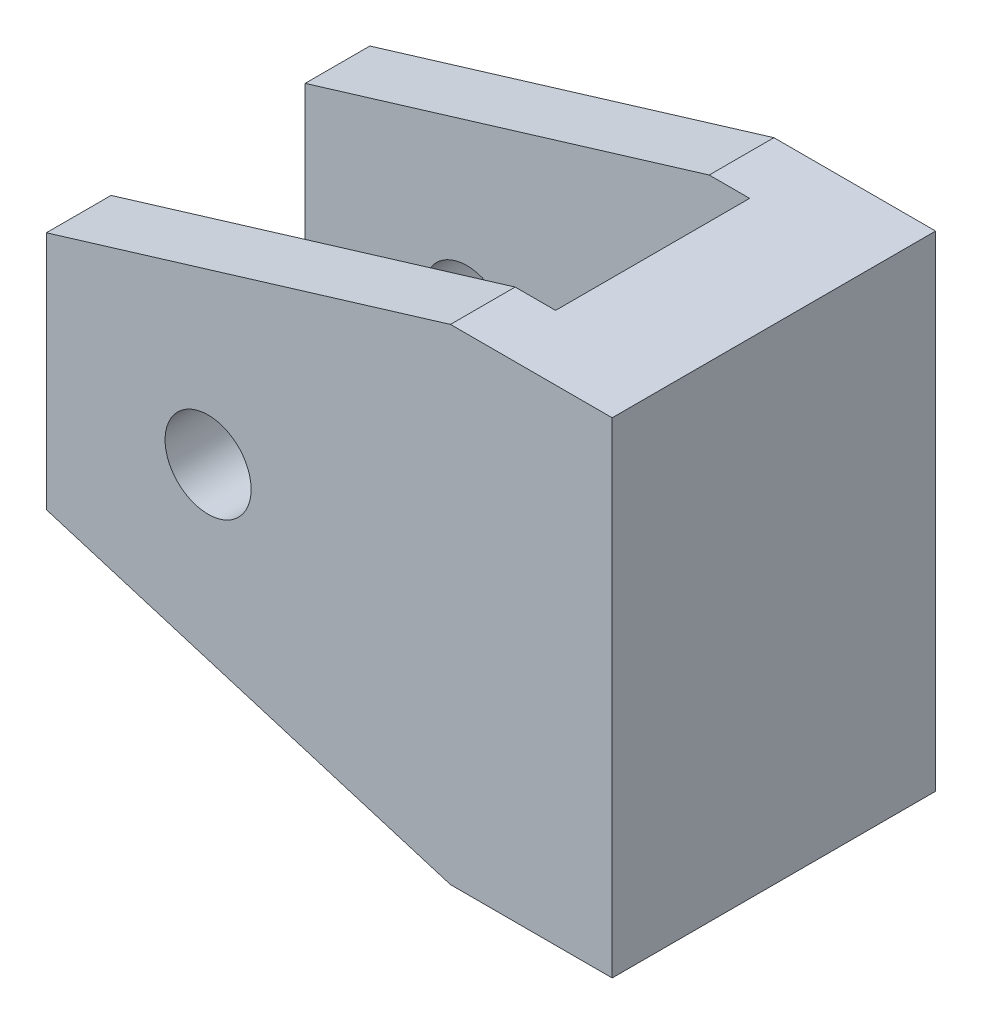
ISO-10303-21;
HEADER;
FILE_DESCRIPTION(('STEP AP214'),'2;1');
FILE_NAME('part.step','',(''),(''),'','','');
FILE_SCHEMA(('AUTOMOTIVE_DESIGN { 1 0 10303 214 1 1 1 1 }'));
ENDSEC;
DATA;
#1=APPLICATION_CONTEXT('core data for automotive mechanical design processes');
#2=APPLICATION_PROTOCOL_DEFINITION('international standard','automotive_design',2000,#1);
#3=PRODUCT_CONTEXT('',#1,'mechanical');
#4=PRODUCT('Part','Part','',(#3));
#5=PRODUCT_RELATED_PRODUCT_CATEGORY('part','',(#4));
#6=PRODUCT_DEFINITION_FORMATION('','',#4);
#7=PRODUCT_DEFINITION_CONTEXT('part definition',#1,'design');
#8=PRODUCT_DEFINITION('design','',#6,#7);
#9=PRODUCT_DEFINITION_SHAPE('','',#8);
#10=(LENGTH_UNIT() NAMED_UNIT(*) SI_UNIT(.MILLI.,.METRE.));
#11=(NAMED_UNIT(*) PLANE_ANGLE_UNIT() SI_UNIT($,.RADIAN.));
#12=(NAMED_UNIT(*) SI_UNIT($,.STERADIAN.) SOLID_ANGLE_UNIT());
#13=UNCERTAINTY_MEASURE_WITH_UNIT(LENGTH_MEASURE(1.E-05),#10,'distance_accuracy_value','');
#14=(GEOMETRIC_REPRESENTATION_CONTEXT(3) GLOBAL_UNCERTAINTY_ASSIGNED_CONTEXT((#13)) GLOBAL_UNIT_ASSIGNED_CONTEXT((#10,
#11,#12)) REPRESENTATION_CONTEXT('',''));
#15=CARTESIAN_POINT('',(0.,0.,0.));
#16=DIRECTION('',(0.,0.,1.));
#17=DIRECTION('',(1.,0.,0.));
#18=AXIS2_PLACEMENT_3D('',#15,#16,#17);
#19=CARTESIAN_POINT('',(556.994122279688,-1577.4906897137,71.2313490571151));
#20=DIRECTION('',(0.290472817587144,0.956883243788387,0.));
#21=DIRECTION('',(-0.956883243788387,0.290472817587144,0.));
#22=AXIS2_PLACEMENT_3D('',#19,#20,#21);
#23=PLANE('',#22);
#24=DIRECTION('',(0.,0.,-1.));
#25=VECTOR('',#24,1.);
#26=CARTESIAN_POINT('',(588.727317330752,-1587.12366284533,71.2313490571151));
#27=LINE('',#26,#25);
#28=CARTESIAN_POINT('',(588.727317330752,-1587.12366284533,-7.62));
#29=VERTEX_POINT('',#28);
#30=CARTESIAN_POINT('',(588.727317330752,-1587.12366284533,-12.7));
#31=VERTEX_POINT('',#30);
#32=EDGE_CURVE('E200',#29,#31,#27,.T.);
#33=ORIENTED_EDGE('',*,*,#32,.F.);
#34=DIRECTION('',(-0.956883243788387,0.290472817587144,0.));
#35=VECTOR('',#34,1.);
#36=CARTESIAN_POINT('',(556.994122279688,-1577.4906897137,-7.62));
#37=LINE('',#36,#35);
#38=CARTESIAN_POINT('',(556.994122279688,-1577.4906897137,-7.61999999999999));
#39=VERTEX_POINT('',#38);
#40=EDGE_CURVE('E163',#29,#39,#37,.T.);
#41=ORIENTED_EDGE('',*,*,#40,.T.);
#42=DIRECTION('',(0.,0.,-1.));
#43=VECTOR('',#42,1.);
#44=CARTESIAN_POINT('',(556.994122279688,-1577.4906897137,71.2313490571151));
#45=LINE('',#44,#43);
#46=CARTESIAN_POINT('',(556.994122279688,-1577.4906897137,-12.7));
#47=VERTEX_POINT('',#46);
#48=EDGE_CURVE('E202',#39,#47,#45,.T.);
#49=ORIENTED_EDGE('',*,*,#48,.T.);
#50=DIRECTION('',(0.956883243788387,-0.290472817587144,0.));
#51=VECTOR('',#50,1.);
#52=CARTESIAN_POINT('',(556.994122279688,-1577.4906897137,-12.7));
#53=LINE('',#52,#51);
#54=EDGE_CURVE('E180',#47,#31,#53,.T.);
#55=ORIENTED_EDGE('',*,*,#54,.T.);
#56=EDGE_LOOP('',(#33,#41,#49,#55));
#57=FACE_BOUND('',#56,.T.);
#58=ADVANCED_FACE('F33',(#57),#23,.F.);
#59=CARTESIAN_POINT('',(556.994122279688,-1558.65663597697,71.2313490571151));
#60=DIRECTION('',(1.,0.,0.));
#61=DIRECTION('',(0.,0.,-1.));
#62=AXIS2_PLACEMENT_3D('',#59,#60,#61);
#63=PLANE('',#62);
#64=ORIENTED_EDGE('',*,*,#48,.F.);
#65=DIRECTION('',(0.,-1.,0.));
#66=VECTOR('',#65,1.);
#67=CARTESIAN_POINT('',(556.994122279688,-1510.93377335057,-7.61999999999999));
#68=LINE('',#67,#66);
#69=CARTESIAN_POINT('',(556.994122279688,-1558.65663597697,-7.61999999999999));
#70=VERTEX_POINT('',#69);
#71=EDGE_CURVE('E152',#70,#39,#68,.T.);
#72=ORIENTED_EDGE('',*,*,#71,.F.);
#73=DIRECTION('',(0.,0.,-1.));
#74=VECTOR('',#73,1.);
#75=CARTESIAN_POINT('',(556.994122279688,-1558.65663597697,71.2313490571151));
#76=LINE('',#75,#74);
#77=CARTESIAN_POINT('',(556.994122279688,-1558.65663597697,-12.7));
#78=VERTEX_POINT('',#77);
#79=EDGE_CURVE('E206',#70,#78,#76,.T.);
#80=ORIENTED_EDGE('',*,*,#79,.T.);
#81=DIRECTION('',(0.,-1.,0.));
#82=VECTOR('',#81,1.);
#83=CARTESIAN_POINT('',(556.994122279688,-1558.65663597697,-12.7));
#84=LINE('',#83,#82);
#85=EDGE_CURVE('E169',#78,#47,#84,.T.);
#86=ORIENTED_EDGE('',*,*,#85,.T.);
#87=EDGE_LOOP('',(#64,#72,#80,#86));
#88=FACE_BOUND('',#87,.T.);
#89=ADVANCED_FACE('F242',(#88),#63,.F.);
#90=CARTESIAN_POINT('',(588.727317330752,-1549.02366284533,71.2313490571151));
#91=DIRECTION('',(0.290472817587131,-0.956883243788391,0.));
#92=DIRECTION('',(0.956883243788391,0.290472817587131,0.));
#93=AXIS2_PLACEMENT_3D('',#90,#91,#92);
#94=PLANE('',#93);
#95=ORIENTED_EDGE('',*,*,#79,.F.);
#96=DIRECTION('',(0.956883243788391,0.290472817587131,0.));
#97=VECTOR('',#96,1.);
#98=CARTESIAN_POINT('',(588.727317330752,-1549.02366284533,-7.62));
#99=LINE('',#98,#97);
#100=CARTESIAN_POINT('',(588.727317330752,-1549.02366284533,-7.62));
#101=VERTEX_POINT('',#100);
#102=EDGE_CURVE('E160',#70,#101,#99,.T.);
#103=ORIENTED_EDGE('',*,*,#102,.T.);
#104=DIRECTION('',(0.,0.,-1.));
#105=VECTOR('',#104,1.);
#106=CARTESIAN_POINT('',(588.727317330752,-1549.02366284533,71.2313490571151));
#107=LINE('',#106,#105);
#108=CARTESIAN_POINT('',(588.727317330752,-1549.02366284533,-12.7));
#109=VERTEX_POINT('',#108);
#110=EDGE_CURVE('E210',#101,#109,#107,.T.);
#111=ORIENTED_EDGE('',*,*,#110,.T.);
#112=DIRECTION('',(-0.956883243788391,-0.290472817587131,0.));
#113=VECTOR('',#112,1.);
#114=CARTESIAN_POINT('',(588.727317330752,-1549.02366284533,-12.7));
#115=LINE('',#114,#113);
#116=EDGE_CURVE('E166',#109,#78,#115,.T.);
#117=ORIENTED_EDGE('',*,*,#116,.T.);
#118=EDGE_LOOP('',(#95,#103,#111,#117));
#119=FACE_BOUND('',#118,.T.);
#120=ADVANCED_FACE('F246',(#119),#94,.F.);
#121=CARTESIAN_POINT('',(601.427317330752,-1549.02366284533,71.2313490571151));
#122=DIRECTION('',(-1.,0.,0.));
#123=DIRECTION('',(0.,0.,1.));
#124=AXIS2_PLACEMENT_3D('',#121,#122,#123);
#125=PLANE('',#124);
#126=DIRECTION('',(0.,0.,-1.));
#127=VECTOR('',#126,1.);
#128=CARTESIAN_POINT('',(601.427317330752,-1549.02366284533,71.2313490571151));
#129=LINE('',#128,#127);
#130=CARTESIAN_POINT('',(601.427317330752,-1549.02366284533,12.7000000000001));
#131=VERTEX_POINT('',#130);
#132=CARTESIAN_POINT('',(601.427317330752,-1549.02366284533,-12.7));
#133=VERTEX_POINT('',#132);
#134=EDGE_CURVE('E173',#131,#133,#129,.T.);
#135=ORIENTED_EDGE('',*,*,#134,.F.);
#136=DIRECTION('',(0.,-1.,0.));
#137=VECTOR('',#136,1.);
#138=CARTESIAN_POINT('',(601.427317330752,-1549.02366284533,12.7000000000001));
#139=LINE('',#138,#137);
#140=CARTESIAN_POINT('',(601.427317330752,-1587.12366284533,12.7000000000001));
#141=VERTEX_POINT('',#140);
#142=EDGE_CURVE('E188',#131,#141,#139,.T.);
#143=ORIENTED_EDGE('',*,*,#142,.T.);
#144=DIRECTION('',(0.,0.,-1.));
#145=VECTOR('',#144,1.);
#146=CARTESIAN_POINT('',(601.427317330752,-1587.12366284533,71.2313490571151));
#147=LINE('',#146,#145);
#148=CARTESIAN_POINT('',(601.427317330752,-1587.12366284533,-12.7));
#149=VERTEX_POINT('',#148);
#150=EDGE_CURVE('E198',#141,#149,#147,.T.);
#151=ORIENTED_EDGE('',*,*,#150,.T.);
#152=DIRECTION('',(0.,1.,0.));
#153=VECTOR('',#152,1.);
#154=CARTESIAN_POINT('',(601.427317330752,-1549.02366284533,-12.7));
#155=LINE('',#154,#153);
#156=EDGE_CURVE('E174',#149,#133,#155,.T.);
#157=ORIENTED_EDGE('',*,*,#156,.T.);
#158=EDGE_LOOP('',(#135,#143,#151,#157));
#159=FACE_BOUND('',#158,.T.);
#160=ADVANCED_FACE('F217',(#159),#125,.F.);
#161=CARTESIAN_POINT('',(588.727317330752,-1587.12366284533,71.2313490571151));
#162=DIRECTION('',(0.,1.,0.));
#163=DIRECTION('',(0.,0.,1.));
#164=AXIS2_PLACEMENT_3D('',#161,#162,#163);
#165=PLANE('',#164);
#166=DIRECTION('',(0.,0.,1.));
#167=VECTOR('',#166,1.);
#168=CARTESIAN_POINT('',(591.902317330752,-1587.12366284533,7.62));
#169=LINE('',#168,#167);
#170=CARTESIAN_POINT('',(591.902317330752,-1587.12366284533,-7.62));
#171=VERTEX_POINT('',#170);
#172=CARTESIAN_POINT('',(591.902317330752,-1587.12366284533,7.62));
#173=VERTEX_POINT('',#172);
#174=EDGE_CURVE('E133',#171,#173,#169,.T.);
#175=ORIENTED_EDGE('',*,*,#174,.F.);
#176=DIRECTION('',(1.,0.,0.));
#177=VECTOR('',#176,1.);
#178=CARTESIAN_POINT('',(591.902317330752,-1587.12366284533,-7.62));
#179=LINE('',#178,#177);
#180=EDGE_CURVE('E129',#29,#171,#179,.T.);
#181=ORIENTED_EDGE('',*,*,#180,.F.);
#182=ORIENTED_EDGE('',*,*,#32,.T.);
#183=DIRECTION('',(1.,0.,0.));
#184=VECTOR('',#183,1.);
#185=CARTESIAN_POINT('',(588.727317330752,-1587.12366284533,-12.7));
#186=LINE('',#185,#184);
#187=EDGE_CURVE('E177',#31,#149,#186,.T.);
#188=ORIENTED_EDGE('',*,*,#187,.T.);
#189=ORIENTED_EDGE('',*,*,#150,.F.);
#190=DIRECTION('',(-1.,0.,0.));
#191=VECTOR('',#190,1.);
#192=CARTESIAN_POINT('',(588.727317330752,-1587.12366284533,12.7000000000001));
#193=LINE('',#192,#191);
#194=CARTESIAN_POINT('',(588.727317330752,-1587.12366284533,12.7000000000001));
#195=VERTEX_POINT('',#194);
#196=EDGE_CURVE('E185',#141,#195,#193,.T.);
#197=ORIENTED_EDGE('',*,*,#196,.T.);
#198=CARTESIAN_POINT('',(588.727317330752,-1587.12366284533,7.62));
#199=VERTEX_POINT('',#198);
#200=EDGE_CURVE('E145',#195,#199,#27,.T.);
#201=ORIENTED_EDGE('',*,*,#200,.T.);
#202=DIRECTION('',(-1.,0.,0.));
#203=VECTOR('',#202,1.);
#204=CARTESIAN_POINT('',(591.902317330752,-1587.12366284533,7.62));
#205=LINE('',#204,#203);
#206=EDGE_CURVE('E124',#173,#199,#205,.T.);
#207=ORIENTED_EDGE('',*,*,#206,.F.);
#208=EDGE_LOOP('',(#175,#181,#182,#188,#189,#197,#201,#207));
#209=FACE_BOUND('',#208,.T.);
#210=ADVANCED_FACE('F142',(#209),#165,.F.);
#211=CARTESIAN_POINT('',(556.994122279688,-1577.4906897137,12.7000000000001));
#212=VERTEX_POINT('',#211);
#213=CARTESIAN_POINT('',(556.994122279688,-1577.4906897137,7.61999999999999));
#214=VERTEX_POINT('',#213);
#215=EDGE_CURVE('E203',#212,#214,#45,.T.);
#216=ORIENTED_EDGE('',*,*,#215,.T.);
#217=DIRECTION('',(0.956883243788387,-0.290472817587144,0.));
#218=VECTOR('',#217,1.);
#219=CARTESIAN_POINT('',(556.994122279688,-1577.4906897137,7.62));
#220=LINE('',#219,#218);
#221=EDGE_CURVE('E157',#214,#199,#220,.T.);
#222=ORIENTED_EDGE('',*,*,#221,.T.);
#223=ORIENTED_EDGE('',*,*,#200,.F.);
#224=DIRECTION('',(-0.956883243788387,0.290472817587144,0.));
#225=VECTOR('',#224,1.);
#226=CARTESIAN_POINT('',(556.994122279688,-1577.4906897137,12.7000000000001));
#227=LINE('',#226,#225);
#228=EDGE_CURVE('E187',#195,#212,#227,.T.);
#229=ORIENTED_EDGE('',*,*,#228,.T.);
#230=EDGE_LOOP('',(#216,#222,#223,#229));
#231=FACE_BOUND('',#230,.T.);
#232=ADVANCED_FACE('F231',(#231),#23,.F.);
#233=CARTESIAN_POINT('',(556.994122279688,-1558.65663597697,12.7000000000001));
#234=VERTEX_POINT('',#233);
#235=CARTESIAN_POINT('',(556.994122279688,-1558.65663597697,7.61999999999999));
#236=VERTEX_POINT('',#235);
#237=EDGE_CURVE('E207',#234,#236,#76,.T.);
#238=ORIENTED_EDGE('',*,*,#237,.T.);
#239=DIRECTION('',(0.,-1.,0.));
#240=VECTOR('',#239,1.);
#241=CARTESIAN_POINT('',(556.994122279688,-1510.93377335057,7.61999999999999));
#242=LINE('',#241,#240);
#243=EDGE_CURVE('E128',#236,#214,#242,.T.);
#244=ORIENTED_EDGE('',*,*,#243,.T.);
#245=ORIENTED_EDGE('',*,*,#215,.F.);
#246=DIRECTION('',(0.,1.,0.));
#247=VECTOR('',#246,1.);
#248=CARTESIAN_POINT('',(556.994122279688,-1558.65663597697,12.7000000000001));
#249=LINE('',#248,#247);
#250=EDGE_CURVE('E191',#212,#234,#249,.T.);
#251=ORIENTED_EDGE('',*,*,#250,.T.);
#252=EDGE_LOOP('',(#238,#244,#245,#251));
#253=FACE_BOUND('',#252,.T.);
#254=ADVANCED_FACE('F229',(#253),#63,.F.);
#255=CARTESIAN_POINT('',(588.727317330752,-1549.02366284533,12.7000000000001));
#256=VERTEX_POINT('',#255);
#257=CARTESIAN_POINT('',(588.727317330752,-1549.02366284533,7.62));
#258=VERTEX_POINT('',#257);
#259=EDGE_CURVE('E211',#256,#258,#107,.T.);
#260=ORIENTED_EDGE('',*,*,#259,.T.);
#261=DIRECTION('',(-0.956883243788391,-0.290472817587131,0.));
#262=VECTOR('',#261,1.);
#263=CARTESIAN_POINT('',(588.727317330752,-1549.02366284533,7.62));
#264=LINE('',#263,#262);
#265=EDGE_CURVE('E49',#258,#236,#264,.T.);
#266=ORIENTED_EDGE('',*,*,#265,.T.);
#267=ORIENTED_EDGE('',*,*,#237,.F.);
#268=DIRECTION('',(0.956883243788391,0.290472817587131,0.));
#269=VECTOR('',#268,1.);
#270=CARTESIAN_POINT('',(588.727317330752,-1549.02366284533,12.7000000000001));
#271=LINE('',#270,#269);
#272=EDGE_CURVE('E56',#234,#256,#271,.T.);
#273=ORIENTED_EDGE('',*,*,#272,.T.);
#274=EDGE_LOOP('',(#260,#266,#267,#273));
#275=FACE_BOUND('',#274,.T.);
#276=ADVANCED_FACE('F226',(#275),#94,.F.);
#277=CARTESIAN_POINT('',(601.427317330752,-1549.02366284533,71.2313490571151));
#278=DIRECTION('',(0.,-1.,0.));
#279=DIRECTION('',(0.,0.,-1.));
#280=AXIS2_PLACEMENT_3D('',#277,#278,#279);
#281=PLANE('',#280);
#282=ORIENTED_EDGE('',*,*,#110,.F.);
#283=DIRECTION('',(-1.,0.,0.));
#284=VECTOR('',#283,1.);
#285=CARTESIAN_POINT('',(591.902317330752,-1549.02366284533,-7.62));
#286=LINE('',#285,#284);
#287=CARTESIAN_POINT('',(591.902317330752,-1549.02366284533,-7.62));
#288=VERTEX_POINT('',#287);
#289=EDGE_CURVE('E151',#288,#101,#286,.T.);
#290=ORIENTED_EDGE('',*,*,#289,.F.);
#291=DIRECTION('',(0.,0.,-1.));
#292=VECTOR('',#291,1.);
#293=CARTESIAN_POINT('',(591.902317330752,-1549.02366284533,7.62));
#294=LINE('',#293,#292);
#295=CARTESIAN_POINT('',(591.902317330752,-1549.02366284533,7.62));
#296=VERTEX_POINT('',#295);
#297=EDGE_CURVE('E158',#296,#288,#294,.T.);
#298=ORIENTED_EDGE('',*,*,#297,.F.);
#299=DIRECTION('',(-1.,0.,0.));
#300=VECTOR('',#299,1.);
#301=CARTESIAN_POINT('',(601.427317330752,-1549.02366284533,7.62));
#302=LINE('',#301,#300);
#303=EDGE_CURVE('E11',#296,#258,#302,.T.);
#304=ORIENTED_EDGE('',*,*,#303,.T.);
#305=ORIENTED_EDGE('',*,*,#259,.F.);
#306=DIRECTION('',(1.,0.,0.));
#307=VECTOR('',#306,1.);
#308=CARTESIAN_POINT('',(601.427317330752,-1549.02366284533,12.7000000000001));
#309=LINE('',#308,#307);
#310=EDGE_CURVE('E42',#256,#131,#309,.T.);
#311=ORIENTED_EDGE('',*,*,#310,.T.);
#312=ORIENTED_EDGE('',*,*,#134,.T.);
#313=DIRECTION('',(-1.,0.,0.));
#314=VECTOR('',#313,1.);
#315=CARTESIAN_POINT('',(601.427317330752,-1549.02366284533,-12.7));
#316=LINE('',#315,#314);
#317=EDGE_CURVE('E170',#133,#109,#316,.T.);
#318=ORIENTED_EDGE('',*,*,#317,.T.);
#319=EDGE_LOOP('',(#282,#290,#298,#304,#305,#311,#312,#318));
#320=FACE_BOUND('',#319,.T.);
#321=ADVANCED_FACE('F35',(#320),#281,.F.);
#322=CARTESIAN_POINT('',(588.727317330752,6.26295879637654E-13,12.6999999999999));
#323=DIRECTION('',(0.,0.,-1.));
#324=DIRECTION('',(-1.,0.,0.));
#325=AXIS2_PLACEMENT_3D('',#322,#323,#324);
#326=PLANE('',#325);
#327=CARTESIAN_POINT('',(569.694122279688,-1568.07366284533,12.6999999999999));
#328=DIRECTION('',(0.,0.,1.));
#329=DIRECTION('',(1.,0.,0.));
#330=AXIS2_PLACEMENT_3D('',#327,#328,#329);
#331=CIRCLE('',#330,3.3782);
#332=CARTESIAN_POINT('',(573.072322279688,-1568.07366284533,12.6999999999999));
#333=VERTEX_POINT('',#332);
#334=EDGE_CURVE('E256',#333,#333,#331,.T.);
#335=ORIENTED_EDGE('',*,*,#334,.F.);
#336=EDGE_LOOP('',(#335));
#337=FACE_BOUND('',#336,.T.);
#338=ORIENTED_EDGE('',*,*,#272,.F.);
#339=ORIENTED_EDGE('',*,*,#250,.F.);
#340=ORIENTED_EDGE('',*,*,#228,.F.);
#341=ORIENTED_EDGE('',*,*,#196,.F.);
#342=ORIENTED_EDGE('',*,*,#142,.F.);
#343=ORIENTED_EDGE('',*,*,#310,.F.);
#344=EDGE_LOOP('',(#338,#339,#340,#341,#342,#343));
#345=FACE_BOUND('',#344,.T.);
#346=ADVANCED_FACE('F220',(#337,#345),#326,.F.);
#347=CARTESIAN_POINT('',(647.217818529146,-1549.02366284533,-12.7));
#348=DIRECTION('',(0.,0.,-1.));
#349=DIRECTION('',(-1.,0.,0.));
#350=AXIS2_PLACEMENT_3D('',#347,#348,#349);
#351=PLANE('',#350);
#352=CARTESIAN_POINT('',(569.694122279688,-1568.07366284533,-12.7000000000001));
#353=DIRECTION('',(0.,0.,1.));
#354=DIRECTION('',(1.,0.,0.));
#355=AXIS2_PLACEMENT_3D('',#352,#353,#354);
#356=CIRCLE('',#355,3.3782);
#357=CARTESIAN_POINT('',(573.072322279688,-1568.07366284533,-12.7000000000001));
#358=VERTEX_POINT('',#357);
#359=EDGE_CURVE('E253',#358,#358,#356,.T.);
#360=ORIENTED_EDGE('',*,*,#359,.T.);
#361=EDGE_LOOP('',(#360));
#362=FACE_BOUND('',#361,.T.);
#363=ORIENTED_EDGE('',*,*,#317,.F.);
#364=ORIENTED_EDGE('',*,*,#156,.F.);
#365=ORIENTED_EDGE('',*,*,#187,.F.);
#366=ORIENTED_EDGE('',*,*,#54,.F.);
#367=ORIENTED_EDGE('',*,*,#85,.F.);
#368=ORIENTED_EDGE('',*,*,#116,.F.);
#369=EDGE_LOOP('',(#363,#364,#365,#366,#367,#368));
#370=FACE_BOUND('',#369,.T.);
#371=ADVANCED_FACE('F236',(#362,#370),#351,.T.);
#372=CARTESIAN_POINT('',(591.902317330752,-1510.93377335057,-7.62));
#373=DIRECTION('',(0.,0.,-1.));
#374=DIRECTION('',(-1.,0.,0.));
#375=AXIS2_PLACEMENT_3D('',#372,#373,#374);
#376=PLANE('',#375);
#377=CARTESIAN_POINT('',(569.694122279688,-1568.07366284533,-7.61999999999999));
#378=DIRECTION('',(0.,0.,-1.));
#379=DIRECTION('',(-1.,0.,0.));
#380=AXIS2_PLACEMENT_3D('',#377,#378,#379);
#381=CIRCLE('',#380,3.3782);
#382=CARTESIAN_POINT('',(566.315922279688,-1568.07366284533,-7.61999999999999));
#383=VERTEX_POINT('',#382);
#384=EDGE_CURVE('E139',#383,#383,#381,.T.);
#385=ORIENTED_EDGE('',*,*,#384,.T.);
#386=EDGE_LOOP('',(#385));
#387=FACE_BOUND('',#386,.T.);
#388=ORIENTED_EDGE('',*,*,#180,.T.);
#389=DIRECTION('',(0.,-1.,0.));
#390=VECTOR('',#389,1.);
#391=CARTESIAN_POINT('',(591.902317330752,-1510.93377335057,-7.62));
#392=LINE('',#391,#390);
#393=EDGE_CURVE('E136',#288,#171,#392,.T.);
#394=ORIENTED_EDGE('',*,*,#393,.F.);
#395=ORIENTED_EDGE('',*,*,#289,.T.);
#396=ORIENTED_EDGE('',*,*,#102,.F.);
#397=ORIENTED_EDGE('',*,*,#71,.T.);
#398=ORIENTED_EDGE('',*,*,#40,.F.);
#399=EDGE_LOOP('',(#388,#394,#395,#396,#397,#398));
#400=FACE_BOUND('',#399,.T.);
#401=ADVANCED_FACE('F269',(#387,#400),#376,.F.);
#402=CARTESIAN_POINT('',(591.902317330752,-1510.93377335057,7.62));
#403=DIRECTION('',(0.,0.,1.));
#404=DIRECTION('',(1.,0.,0.));
#405=AXIS2_PLACEMENT_3D('',#402,#403,#404);
#406=PLANE('',#405);
#407=CARTESIAN_POINT('',(569.694122279688,-1568.07366284533,7.61999999999999));
#408=DIRECTION('',(0.,0.,1.));
#409=DIRECTION('',(1.,0.,0.));
#410=AXIS2_PLACEMENT_3D('',#407,#408,#409);
#411=CIRCLE('',#410,3.3782);
#412=CARTESIAN_POINT('',(573.072322279688,-1568.07366284533,7.62));
#413=VERTEX_POINT('',#412);
#414=EDGE_CURVE('E37',#413,#413,#411,.T.);
#415=ORIENTED_EDGE('',*,*,#414,.T.);
#416=EDGE_LOOP('',(#415));
#417=FACE_BOUND('',#416,.T.);
#418=ORIENTED_EDGE('',*,*,#243,.F.);
#419=ORIENTED_EDGE('',*,*,#265,.F.);
#420=ORIENTED_EDGE('',*,*,#303,.F.);
#421=DIRECTION('',(0.,-1.,0.));
#422=VECTOR('',#421,1.);
#423=CARTESIAN_POINT('',(591.902317330752,-1510.93377335057,7.62));
#424=LINE('',#423,#422);
#425=EDGE_CURVE('E120',#296,#173,#424,.T.);
#426=ORIENTED_EDGE('',*,*,#425,.T.);
#427=ORIENTED_EDGE('',*,*,#206,.T.);
#428=ORIENTED_EDGE('',*,*,#221,.F.);
#429=EDGE_LOOP('',(#418,#419,#420,#426,#427,#428));
#430=FACE_BOUND('',#429,.T.);
#431=ADVANCED_FACE('F122',(#417,#430),#406,.F.);
#432=CARTESIAN_POINT('',(591.902317330752,-1510.93377335057,7.62));
#433=DIRECTION('',(1.,0.,0.));
#434=DIRECTION('',(0.,0.,-1.));
#435=AXIS2_PLACEMENT_3D('',#432,#433,#434);
#436=PLANE('',#435);
#437=ORIENTED_EDGE('',*,*,#297,.T.);
#438=ORIENTED_EDGE('',*,*,#393,.T.);
#439=ORIENTED_EDGE('',*,*,#174,.T.);
#440=ORIENTED_EDGE('',*,*,#425,.F.);
#441=EDGE_LOOP('',(#437,#438,#439,#440));
#442=FACE_BOUND('',#441,.T.);
#443=ADVANCED_FACE('F134',(#442),#436,.F.);
#444=CARTESIAN_POINT('',(569.694122279688,-1568.07366284533,12.6999999999999));
#445=DIRECTION('',(0.,0.,1.));
#446=DIRECTION('',(1.,0.,0.));
#447=AXIS2_PLACEMENT_3D('',#444,#445,#446);
#448=CYLINDRICAL_SURFACE('',#447,3.3782);
#449=ORIENTED_EDGE('',*,*,#334,.T.);
#450=EDGE_LOOP('',(#449));
#451=FACE_BOUND('',#450,.T.);
#452=ORIENTED_EDGE('',*,*,#414,.F.);
#453=EDGE_LOOP('',(#452));
#454=FACE_BOUND('',#453,.T.);
#455=ADVANCED_FACE('F260',(#451,#454),#448,.F.);
#456=ORIENTED_EDGE('',*,*,#359,.F.);
#457=EDGE_LOOP('',(#456));
#458=FACE_BOUND('',#457,.T.);
#459=ORIENTED_EDGE('',*,*,#384,.F.);
#460=EDGE_LOOP('',(#459));
#461=FACE_BOUND('',#460,.T.);
#462=ADVANCED_FACE('F349',(#458,#461),#448,.F.);
#463=CLOSED_SHELL('',(#58,#89,#120,#160,#210,#232,#254,#276,#321,#346,#371,#401,#431,#443,#455,#462));
#464=MANIFOLD_SOLID_BREP('B2',#463);
#465=ADVANCED_BREP_SHAPE_REPRESENTATION('',(#18,#464),#14);
#466=SHAPE_DEFINITION_REPRESENTATION(#9,#465);
ENDSEC;
END-ISO-10303-21;
